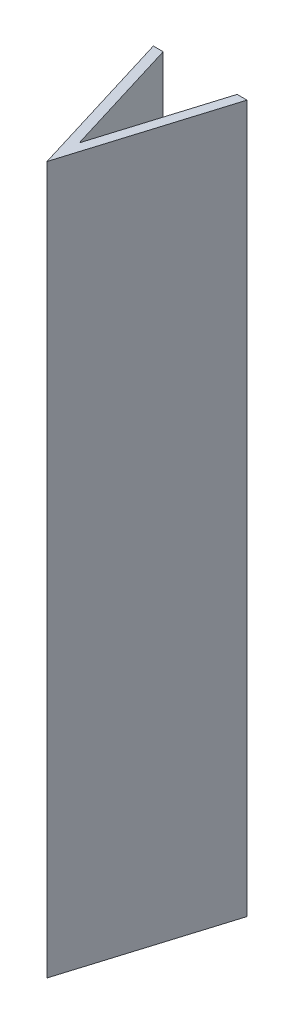
ISO-10303-21;
HEADER;
FILE_DESCRIPTION(('STEP AP214'),'2;1');
FILE_NAME('part.step','',(''),(''),'','','');
FILE_SCHEMA(('AUTOMOTIVE_DESIGN { 1 0 10303 214 1 1 1 1 }'));
ENDSEC;
DATA;
#1=APPLICATION_CONTEXT('core data for automotive mechanical design processes');
#2=APPLICATION_PROTOCOL_DEFINITION('international standard','automotive_design',2000,#1);
#3=PRODUCT_CONTEXT('',#1,'mechanical');
#4=PRODUCT('Part','Part','',(#3));
#5=PRODUCT_RELATED_PRODUCT_CATEGORY('part','',(#4));
#6=PRODUCT_DEFINITION_FORMATION('','',#4);
#7=PRODUCT_DEFINITION_CONTEXT('part definition',#1,'design');
#8=PRODUCT_DEFINITION('design','',#6,#7);
#9=PRODUCT_DEFINITION_SHAPE('','',#8);
#10=(LENGTH_UNIT() NAMED_UNIT(*) SI_UNIT(.MILLI.,.METRE.));
#11=(NAMED_UNIT(*) PLANE_ANGLE_UNIT() SI_UNIT($,.RADIAN.));
#12=(NAMED_UNIT(*) SI_UNIT($,.STERADIAN.) SOLID_ANGLE_UNIT());
#13=UNCERTAINTY_MEASURE_WITH_UNIT(LENGTH_MEASURE(1.E-05),#10,'distance_accuracy_value','');
#14=(GEOMETRIC_REPRESENTATION_CONTEXT(3) GLOBAL_UNCERTAINTY_ASSIGNED_CONTEXT((#13)) GLOBAL_UNIT_ASSIGNED_CONTEXT((#10,
#11,#12)) REPRESENTATION_CONTEXT('',''));
#15=CARTESIAN_POINT('',(0.,0.,0.));
#16=DIRECTION('',(0.,0.,1.));
#17=DIRECTION('',(1.,0.,0.));
#18=AXIS2_PLACEMENT_3D('',#15,#16,#17);
#19=CARTESIAN_POINT('',(-1.01365400260447,-2.51,16.5653700090289));
#20=DIRECTION('',(0.,0.,-1.));
#21=DIRECTION('',(-1.,0.,0.));
#22=AXIS2_PLACEMENT_3D('',#19,#20,#21);
#23=PLANE('',#22);
#24=DIRECTION('',(0.,1.,0.));
#25=VECTOR('',#24,1.);
#26=CARTESIAN_POINT('',(-0.804515651307037,-2.51,16.5653700090289));
#27=LINE('',#26,#25);
#28=CARTESIAN_POINT('',(-0.804515651307037,-2.5,16.5653700090289));
#29=VERTEX_POINT('',#28);
#30=CARTESIAN_POINT('',(-0.804515651307037,12.5,16.5653700090289));
#31=VERTEX_POINT('',#30);
#32=EDGE_CURVE('E11',#29,#31,#27,.T.);
#33=ORIENTED_EDGE('',*,*,#32,.F.);
#34=DIRECTION('',(-1.,0.,0.));
#35=VECTOR('',#34,1.);
#36=CARTESIAN_POINT('',(0.,-2.5,16.5653700090289));
#37=LINE('',#36,#35);
#38=CARTESIAN_POINT('',(-1.01365400260447,-2.5,16.5653700090289));
#39=VERTEX_POINT('',#38);
#40=EDGE_CURVE('E89',#29,#39,#37,.T.);
#41=ORIENTED_EDGE('',*,*,#40,.T.);
#42=DIRECTION('',(0.,-1.,0.));
#43=VECTOR('',#42,1.);
#44=CARTESIAN_POINT('',(-1.01365400260447,-2.5,16.5653700090289));
#45=LINE('',#44,#43);
#46=CARTESIAN_POINT('',(-1.01365400260447,12.5,16.5653700090289));
#47=VERTEX_POINT('',#46);
#48=EDGE_CURVE('E95',#47,#39,#45,.T.);
#49=ORIENTED_EDGE('',*,*,#48,.F.);
#50=DIRECTION('',(-1.,0.,0.));
#51=VECTOR('',#50,1.);
#52=CARTESIAN_POINT('',(0.,12.5,16.5653700090289));
#53=LINE('',#52,#51);
#54=EDGE_CURVE('E118',#31,#47,#53,.T.);
#55=ORIENTED_EDGE('',*,*,#54,.F.);
#56=EDGE_LOOP('',(#33,#41,#49,#55));
#57=FACE_BOUND('',#56,.T.);
#58=ADVANCED_FACE('F32',(#57),#23,.T.);
#59=CARTESIAN_POINT('',(-0.0200292878637935,-2.51,19.1313092850622));
#60=DIRECTION('',(0.956304755963033,0.,-0.292371704722745));
#61=DIRECTION('',(-0.292371704722745,0.,-0.956304755963033));
#62=AXIS2_PLACEMENT_3D('',#59,#60,#61);
#63=PLANE('',#62);
#64=DIRECTION('',(0.,1.,0.));
#65=VECTOR('',#64,1.);
#66=CARTESIAN_POINT('',(-0.0200292878637935,-2.51,19.1313092850622));
#67=LINE('',#66,#65);
#68=CARTESIAN_POINT('',(-0.0200292878637948,-2.5,19.1313092850622));
#69=VERTEX_POINT('',#68);
#70=CARTESIAN_POINT('',(-0.0200292878637948,12.5,19.1313092850622));
#71=VERTEX_POINT('',#70);
#72=EDGE_CURVE('E41',#69,#71,#67,.T.);
#73=ORIENTED_EDGE('',*,*,#72,.F.);
#74=DIRECTION('',(-0.292371704722745,0.,-0.956304755963033));
#75=VECTOR('',#74,1.);
#76=CARTESIAN_POINT('',(-5.36736335318275,-2.5,1.64096765560485));
#77=LINE('',#76,#75);
#78=EDGE_CURVE('E102',#69,#29,#77,.T.);
#79=ORIENTED_EDGE('',*,*,#78,.T.);
#80=ORIENTED_EDGE('',*,*,#32,.T.);
#81=DIRECTION('',(-0.292371704722745,0.,-0.956304755963033));
#82=VECTOR('',#81,1.);
#83=CARTESIAN_POINT('',(-5.36736335318275,12.5,1.64096765560485));
#84=LINE('',#83,#82);
#85=EDGE_CURVE('E120',#71,#31,#84,.T.);
#86=ORIENTED_EDGE('',*,*,#85,.F.);
#87=EDGE_LOOP('',(#73,#79,#80,#86));
#88=FACE_BOUND('',#87,.T.);
#89=ADVANCED_FACE('F151',(#88),#63,.T.);
#90=CARTESIAN_POINT('',(0.764457075579426,-2.51,16.5653700090289));
#91=DIRECTION('',(-0.956304755963036,0.,-0.292371704722737));
#92=DIRECTION('',(-0.292371704722737,0.,0.956304755963036));
#93=AXIS2_PLACEMENT_3D('',#90,#91,#92);
#94=PLANE('',#93);
#95=DIRECTION('',(0.,1.,0.));
#96=VECTOR('',#95,1.);
#97=CARTESIAN_POINT('',(0.764457075579426,-2.51,16.5653700090289));
#98=LINE('',#97,#96);
#99=CARTESIAN_POINT('',(0.764457075579427,-2.5,16.5653700090289));
#100=VERTEX_POINT('',#99);
#101=CARTESIAN_POINT('',(0.764457075579427,12.5,16.5653700090289));
#102=VERTEX_POINT('',#101);
#103=EDGE_CURVE('E111',#100,#102,#98,.T.);
#104=ORIENTED_EDGE('',*,*,#103,.F.);
#105=DIRECTION('',(-0.292371704722737,0.,0.956304755963036));
#106=VECTOR('',#105,1.);
#107=CARTESIAN_POINT('',(5.33072903312821,-2.5,1.62976741996975));
#108=LINE('',#107,#106);
#109=EDGE_CURVE('E104',#100,#69,#108,.T.);
#110=ORIENTED_EDGE('',*,*,#109,.T.);
#111=ORIENTED_EDGE('',*,*,#72,.T.);
#112=DIRECTION('',(-0.292371704722737,0.,0.956304755963036));
#113=VECTOR('',#112,1.);
#114=CARTESIAN_POINT('',(5.33072903312821,12.5,1.62976741996975));
#115=LINE('',#114,#113);
#116=EDGE_CURVE('E123',#102,#71,#115,.T.);
#117=ORIENTED_EDGE('',*,*,#116,.F.);
#118=EDGE_LOOP('',(#104,#110,#111,#117));
#119=FACE_BOUND('',#118,.T.);
#120=ADVANCED_FACE('F133',(#119),#94,.T.);
#121=CARTESIAN_POINT('',(0.973595426876855,-2.51,16.5653700090289));
#122=DIRECTION('',(0.,0.,-1.));
#123=DIRECTION('',(-1.,0.,0.));
#124=AXIS2_PLACEMENT_3D('',#121,#122,#123);
#125=PLANE('',#124);
#126=DIRECTION('',(0.,1.,0.));
#127=VECTOR('',#126,1.);
#128=CARTESIAN_POINT('',(0.973595426876858,-2.5,16.5653700090289));
#129=LINE('',#128,#127);
#130=CARTESIAN_POINT('',(0.973595426876858,-2.5,16.5653700090289));
#131=VERTEX_POINT('',#130);
#132=CARTESIAN_POINT('',(0.973595426876858,12.5,16.5653700090289));
#133=VERTEX_POINT('',#132);
#134=EDGE_CURVE('E99',#131,#133,#129,.T.);
#135=ORIENTED_EDGE('',*,*,#134,.F.);
#136=DIRECTION('',(-1.,0.,0.));
#137=VECTOR('',#136,1.);
#138=CARTESIAN_POINT('',(0.,-2.5,16.5653700090289));
#139=LINE('',#138,#137);
#140=EDGE_CURVE('E100',#131,#100,#139,.T.);
#141=ORIENTED_EDGE('',*,*,#140,.T.);
#142=ORIENTED_EDGE('',*,*,#103,.T.);
#143=DIRECTION('',(-1.,0.,0.));
#144=VECTOR('',#143,1.);
#145=CARTESIAN_POINT('',(0.,12.5,16.5653700090289));
#146=LINE('',#145,#144);
#147=EDGE_CURVE('E126',#133,#102,#146,.T.);
#148=ORIENTED_EDGE('',*,*,#147,.F.);
#149=EDGE_LOOP('',(#135,#141,#142,#148));
#150=FACE_BOUND('',#149,.T.);
#151=ADVANCED_FACE('F136',(#150),#125,.T.);
#152=CARTESIAN_POINT('',(0.,12.5,0.));
#153=DIRECTION('',(0.,1.,0.));
#154=DIRECTION('',(0.,0.,1.));
#155=AXIS2_PLACEMENT_3D('',#152,#153,#154);
#156=PLANE('',#155);
#157=DIRECTION('',(0.292371704722737,0.,-0.956304755963035));
#158=VECTOR('',#157,1.);
#159=CARTESIAN_POINT('',(0.973595426876858,12.5,16.5653700090289));
#160=LINE('',#159,#158);
#161=CARTESIAN_POINT('',(-0.0200292878637907,12.5,19.8153700090289));
#162=VERTEX_POINT('',#161);
#163=EDGE_CURVE('E92',#162,#133,#160,.T.);
#164=ORIENTED_EDGE('',*,*,#163,.T.);
#165=ORIENTED_EDGE('',*,*,#147,.T.);
#166=ORIENTED_EDGE('',*,*,#116,.T.);
#167=ORIENTED_EDGE('',*,*,#85,.T.);
#168=ORIENTED_EDGE('',*,*,#54,.T.);
#169=DIRECTION('',(0.292371704722747,0.,0.956304755963032));
#170=VECTOR('',#169,1.);
#171=CARTESIAN_POINT('',(-0.0200292878637907,12.5,19.8153700090289));
#172=LINE('',#171,#170);
#173=EDGE_CURVE('E36',#47,#162,#172,.T.);
#174=ORIENTED_EDGE('',*,*,#173,.T.);
#175=EDGE_LOOP('',(#164,#165,#166,#167,#168,#174));
#176=FACE_BOUND('',#175,.T.);
#177=ADVANCED_FACE('F141',(#176),#156,.T.);
#178=CARTESIAN_POINT('',(0.973595426876858,-2.5,16.5653700090289));
#179=DIRECTION('',(0.956304755963036,0.,0.292371704722736));
#180=DIRECTION('',(0.292371704722736,0.,-0.956304755963036));
#181=AXIS2_PLACEMENT_3D('',#178,#179,#180);
#182=PLANE('',#181);
#183=DIRECTION('',(0.292371704722737,0.,-0.956304755963035));
#184=VECTOR('',#183,1.);
#185=CARTESIAN_POINT('',(0.973595426876858,-2.5,16.5653700090289));
#186=LINE('',#185,#184);
#187=CARTESIAN_POINT('',(-0.0200292878637907,-2.5,19.8153700090289));
#188=VERTEX_POINT('',#187);
#189=EDGE_CURVE('E91',#188,#131,#186,.T.);
#190=ORIENTED_EDGE('',*,*,#189,.T.);
#191=ORIENTED_EDGE('',*,*,#134,.T.);
#192=ORIENTED_EDGE('',*,*,#163,.F.);
#193=DIRECTION('',(0.,1.,0.));
#194=VECTOR('',#193,1.);
#195=CARTESIAN_POINT('',(-0.0200292878637907,-2.5,19.8153700090289));
#196=LINE('',#195,#194);
#197=EDGE_CURVE('E108',#188,#162,#196,.T.);
#198=ORIENTED_EDGE('',*,*,#197,.F.);
#199=EDGE_LOOP('',(#190,#191,#192,#198));
#200=FACE_BOUND('',#199,.T.);
#201=ADVANCED_FACE('F138',(#200),#182,.T.);
#202=CARTESIAN_POINT('',(-1.01365400260447,-2.5,16.5653700090289));
#203=DIRECTION('',(-0.956304755963033,0.,0.292371704722745));
#204=DIRECTION('',(0.292371704722745,0.,0.956304755963033));
#205=AXIS2_PLACEMENT_3D('',#202,#203,#204);
#206=PLANE('',#205);
#207=ORIENTED_EDGE('',*,*,#173,.F.);
#208=ORIENTED_EDGE('',*,*,#48,.T.);
#209=DIRECTION('',(0.292371704722747,0.,0.956304755963032));
#210=VECTOR('',#209,1.);
#211=CARTESIAN_POINT('',(-0.0200292878637907,-2.5,19.8153700090289));
#212=LINE('',#211,#210);
#213=EDGE_CURVE('E55',#39,#188,#212,.T.);
#214=ORIENTED_EDGE('',*,*,#213,.T.);
#215=ORIENTED_EDGE('',*,*,#197,.T.);
#216=EDGE_LOOP('',(#207,#208,#214,#215));
#217=FACE_BOUND('',#216,.T.);
#218=ADVANCED_FACE('F96',(#217),#206,.T.);
#219=CARTESIAN_POINT('',(0.,-2.5,0.));
#220=DIRECTION('',(0.,1.,0.));
#221=DIRECTION('',(0.,0.,1.));
#222=AXIS2_PLACEMENT_3D('',#219,#220,#221);
#223=PLANE('',#222);
#224=ORIENTED_EDGE('',*,*,#140,.F.);
#225=ORIENTED_EDGE('',*,*,#189,.F.);
#226=ORIENTED_EDGE('',*,*,#213,.F.);
#227=ORIENTED_EDGE('',*,*,#40,.F.);
#228=ORIENTED_EDGE('',*,*,#78,.F.);
#229=ORIENTED_EDGE('',*,*,#109,.F.);
#230=EDGE_LOOP('',(#224,#225,#226,#227,#228,#229));
#231=FACE_BOUND('',#230,.T.);
#232=ADVANCED_FACE('F34',(#231),#223,.F.);
#233=CLOSED_SHELL('',(#58,#89,#120,#151,#177,#201,#218,#232));
#234=MANIFOLD_SOLID_BREP('B2',#233);
#235=ADVANCED_BREP_SHAPE_REPRESENTATION('',(#18,#234),#14);
#236=SHAPE_DEFINITION_REPRESENTATION(#9,#235);
ENDSEC;
END-ISO-10303-21;
